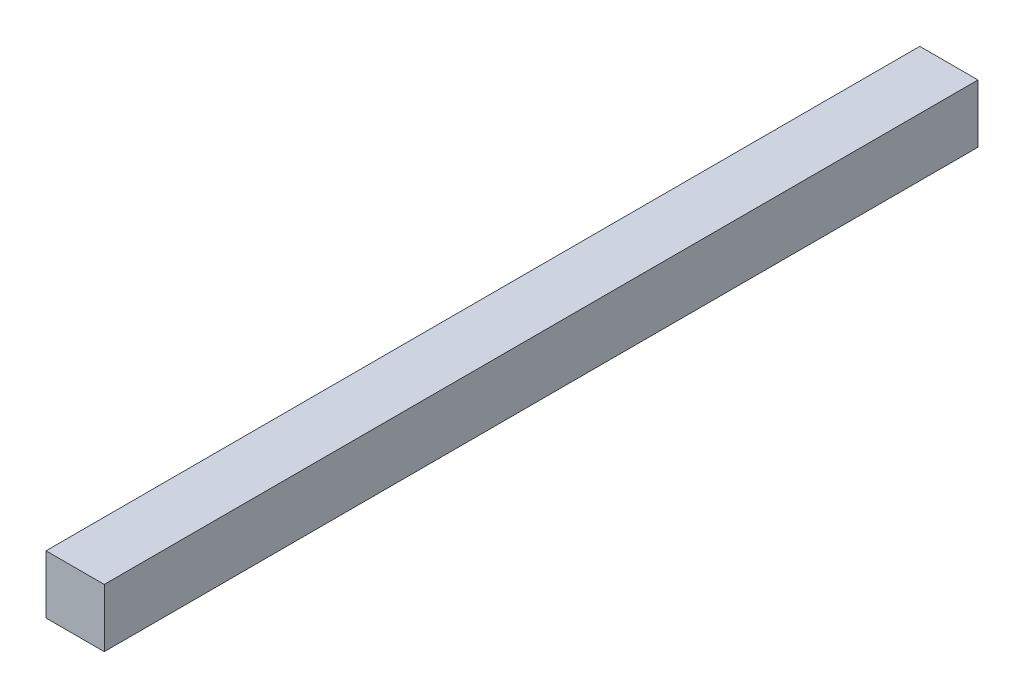
ISO-10303-21;
HEADER;
FILE_DESCRIPTION(('STEP AP214'),'2;1');
FILE_NAME('part.step','',(''),(''),'','','');
FILE_SCHEMA(('AUTOMOTIVE_DESIGN { 1 0 10303 214 1 1 1 1 }'));
ENDSEC;
DATA;
#1=APPLICATION_CONTEXT('core data for automotive mechanical design processes');
#2=APPLICATION_PROTOCOL_DEFINITION('international standard','automotive_design',2000,#1);
#3=PRODUCT_CONTEXT('',#1,'mechanical');
#4=PRODUCT('Part','Part','',(#3));
#5=PRODUCT_RELATED_PRODUCT_CATEGORY('part','',(#4));
#6=PRODUCT_DEFINITION_FORMATION('','',#4);
#7=PRODUCT_DEFINITION_CONTEXT('part definition',#1,'design');
#8=PRODUCT_DEFINITION('design','',#6,#7);
#9=PRODUCT_DEFINITION_SHAPE('','',#8);
#10=(LENGTH_UNIT() NAMED_UNIT(*) SI_UNIT(.MILLI.,.METRE.));
#11=(NAMED_UNIT(*) PLANE_ANGLE_UNIT() SI_UNIT($,.RADIAN.));
#12=(NAMED_UNIT(*) SI_UNIT($,.STERADIAN.) SOLID_ANGLE_UNIT());
#13=UNCERTAINTY_MEASURE_WITH_UNIT(LENGTH_MEASURE(1.E-05),#10,'distance_accuracy_value','');
#14=(GEOMETRIC_REPRESENTATION_CONTEXT(3) GLOBAL_UNCERTAINTY_ASSIGNED_CONTEXT((#13)) GLOBAL_UNIT_ASSIGNED_CONTEXT((#10,
#11,#12)) REPRESENTATION_CONTEXT('',''));
#15=CARTESIAN_POINT('',(0.,0.,0.));
#16=DIRECTION('',(0.,0.,1.));
#17=DIRECTION('',(1.,0.,0.));
#18=AXIS2_PLACEMENT_3D('',#15,#16,#17);
#19=CARTESIAN_POINT('',(10.16,-10.16,152.4));
#20=DIRECTION('',(-1.,0.,0.));
#21=DIRECTION('',(0.,0.,1.));
#22=AXIS2_PLACEMENT_3D('',#19,#20,#21);
#23=PLANE('',#22);
#24=DIRECTION('',(0.,1.,0.));
#25=VECTOR('',#24,1.);
#26=CARTESIAN_POINT('',(10.16,-10.16,-152.4));
#27=LINE('',#26,#25);
#28=CARTESIAN_POINT('',(10.16,-10.16,-152.4));
#29=VERTEX_POINT('',#28);
#30=CARTESIAN_POINT('',(10.16,10.16,-152.4));
#31=VERTEX_POINT('',#30);
#32=EDGE_CURVE('E102',#29,#31,#27,.T.);
#33=ORIENTED_EDGE('',*,*,#32,.T.);
#34=DIRECTION('',(0.,0.,-1.));
#35=VECTOR('',#34,1.);
#36=CARTESIAN_POINT('',(10.16,10.16,152.4));
#37=LINE('',#36,#35);
#38=CARTESIAN_POINT('',(10.16,10.16,152.4));
#39=VERTEX_POINT('',#38);
#40=EDGE_CURVE('E11',#39,#31,#37,.T.);
#41=ORIENTED_EDGE('',*,*,#40,.F.);
#42=DIRECTION('',(0.,1.,0.));
#43=VECTOR('',#42,1.);
#44=CARTESIAN_POINT('',(10.16,-10.16,152.4));
#45=LINE('',#44,#43);
#46=CARTESIAN_POINT('',(10.16,-10.16,152.4));
#47=VERTEX_POINT('',#46);
#48=EDGE_CURVE('E90',#47,#39,#45,.T.);
#49=ORIENTED_EDGE('',*,*,#48,.F.);
#50=DIRECTION('',(0.,0.,-1.));
#51=VECTOR('',#50,1.);
#52=CARTESIAN_POINT('',(10.16,-10.16,152.4));
#53=LINE('',#52,#51);
#54=EDGE_CURVE('E98',#47,#29,#53,.T.);
#55=ORIENTED_EDGE('',*,*,#54,.T.);
#56=EDGE_LOOP('',(#33,#41,#49,#55));
#57=FACE_BOUND('',#56,.T.);
#58=ADVANCED_FACE('F39',(#57),#23,.F.);
#59=CARTESIAN_POINT('',(-10.16,10.16,152.4));
#60=DIRECTION('',(0.,-1.,0.));
#61=DIRECTION('',(0.,0.,-1.));
#62=AXIS2_PLACEMENT_3D('',#59,#60,#61);
#63=PLANE('',#62);
#64=DIRECTION('',(-1.,0.,0.));
#65=VECTOR('',#64,1.);
#66=CARTESIAN_POINT('',(-10.16,10.16,-152.4));
#67=LINE('',#66,#65);
#68=CARTESIAN_POINT('',(-10.16,10.16,-152.4));
#69=VERTEX_POINT('',#68);
#70=EDGE_CURVE('E94',#31,#69,#67,.T.);
#71=ORIENTED_EDGE('',*,*,#70,.T.);
#72=DIRECTION('',(0.,0.,-1.));
#73=VECTOR('',#72,1.);
#74=CARTESIAN_POINT('',(-10.16,10.16,152.4));
#75=LINE('',#74,#73);
#76=CARTESIAN_POINT('',(-10.16,10.16,152.4));
#77=VERTEX_POINT('',#76);
#78=EDGE_CURVE('E47',#77,#69,#75,.T.);
#79=ORIENTED_EDGE('',*,*,#78,.F.);
#80=DIRECTION('',(-1.,0.,0.));
#81=VECTOR('',#80,1.);
#82=CARTESIAN_POINT('',(-10.16,10.16,152.4));
#83=LINE('',#82,#81);
#84=EDGE_CURVE('E85',#39,#77,#83,.T.);
#85=ORIENTED_EDGE('',*,*,#84,.F.);
#86=ORIENTED_EDGE('',*,*,#40,.T.);
#87=EDGE_LOOP('',(#71,#79,#85,#86));
#88=FACE_BOUND('',#87,.T.);
#89=ADVANCED_FACE('F93',(#88),#63,.F.);
#90=CARTESIAN_POINT('',(-10.16,-10.16,152.4));
#91=DIRECTION('',(1.,0.,0.));
#92=DIRECTION('',(0.,0.,-1.));
#93=AXIS2_PLACEMENT_3D('',#90,#91,#92);
#94=PLANE('',#93);
#95=DIRECTION('',(0.,-1.,0.));
#96=VECTOR('',#95,1.);
#97=CARTESIAN_POINT('',(-10.16,-10.16,-152.4));
#98=LINE('',#97,#96);
#99=CARTESIAN_POINT('',(-10.16,-10.16,-152.4));
#100=VERTEX_POINT('',#99);
#101=EDGE_CURVE('E72',#69,#100,#98,.T.);
#102=ORIENTED_EDGE('',*,*,#101,.T.);
#103=DIRECTION('',(0.,0.,-1.));
#104=VECTOR('',#103,1.);
#105=CARTESIAN_POINT('',(-10.16,-10.16,152.4));
#106=LINE('',#105,#104);
#107=CARTESIAN_POINT('',(-10.16,-10.16,152.4));
#108=VERTEX_POINT('',#107);
#109=EDGE_CURVE('E95',#108,#100,#106,.T.);
#110=ORIENTED_EDGE('',*,*,#109,.F.);
#111=DIRECTION('',(0.,-1.,0.));
#112=VECTOR('',#111,1.);
#113=CARTESIAN_POINT('',(-10.16,-10.16,152.4));
#114=LINE('',#113,#112);
#115=EDGE_CURVE('E88',#77,#108,#114,.T.);
#116=ORIENTED_EDGE('',*,*,#115,.F.);
#117=ORIENTED_EDGE('',*,*,#78,.T.);
#118=EDGE_LOOP('',(#102,#110,#116,#117));
#119=FACE_BOUND('',#118,.T.);
#120=ADVANCED_FACE('F96',(#119),#94,.F.);
#121=CARTESIAN_POINT('',(-10.16,-10.16,152.4));
#122=DIRECTION('',(0.,1.,0.));
#123=DIRECTION('',(0.,0.,1.));
#124=AXIS2_PLACEMENT_3D('',#121,#122,#123);
#125=PLANE('',#124);
#126=DIRECTION('',(1.,0.,0.));
#127=VECTOR('',#126,1.);
#128=CARTESIAN_POINT('',(-10.16,-10.16,-152.4));
#129=LINE('',#128,#127);
#130=EDGE_CURVE('E78',#100,#29,#129,.T.);
#131=ORIENTED_EDGE('',*,*,#130,.T.);
#132=ORIENTED_EDGE('',*,*,#54,.F.);
#133=DIRECTION('',(1.,0.,0.));
#134=VECTOR('',#133,1.);
#135=CARTESIAN_POINT('',(-10.16,-10.16,152.4));
#136=LINE('',#135,#134);
#137=EDGE_CURVE('E55',#108,#47,#136,.T.);
#138=ORIENTED_EDGE('',*,*,#137,.F.);
#139=ORIENTED_EDGE('',*,*,#109,.T.);
#140=EDGE_LOOP('',(#131,#132,#138,#139));
#141=FACE_BOUND('',#140,.T.);
#142=ADVANCED_FACE('F109',(#141),#125,.F.);
#143=CARTESIAN_POINT('',(0.,0.,152.4));
#144=DIRECTION('',(0.,0.,-1.));
#145=DIRECTION('',(-1.,0.,0.));
#146=AXIS2_PLACEMENT_3D('',#143,#144,#145);
#147=PLANE('',#146);
#148=ORIENTED_EDGE('',*,*,#48,.T.);
#149=ORIENTED_EDGE('',*,*,#84,.T.);
#150=ORIENTED_EDGE('',*,*,#115,.T.);
#151=ORIENTED_EDGE('',*,*,#137,.T.);
#152=EDGE_LOOP('',(#148,#149,#150,#151));
#153=FACE_BOUND('',#152,.T.);
#154=ADVANCED_FACE('F86',(#153),#147,.F.);
#155=CARTESIAN_POINT('',(0.,0.,-152.4));
#156=DIRECTION('',(0.,0.,-1.));
#157=DIRECTION('',(-1.,0.,0.));
#158=AXIS2_PLACEMENT_3D('',#155,#156,#157);
#159=PLANE('',#158);
#160=ORIENTED_EDGE('',*,*,#32,.F.);
#161=ORIENTED_EDGE('',*,*,#130,.F.);
#162=ORIENTED_EDGE('',*,*,#101,.F.);
#163=ORIENTED_EDGE('',*,*,#70,.F.);
#164=EDGE_LOOP('',(#160,#161,#162,#163));
#165=FACE_BOUND('',#164,.T.);
#166=ADVANCED_FACE('F112',(#165),#159,.T.);
#167=CLOSED_SHELL('',(#58,#89,#120,#142,#154,#166));
#168=MANIFOLD_SOLID_BREP('B2',#167);
#169=ADVANCED_BREP_SHAPE_REPRESENTATION('',(#18,#168),#14);
#170=SHAPE_DEFINITION_REPRESENTATION(#9,#169);
ENDSEC;
END-ISO-10303-21;
